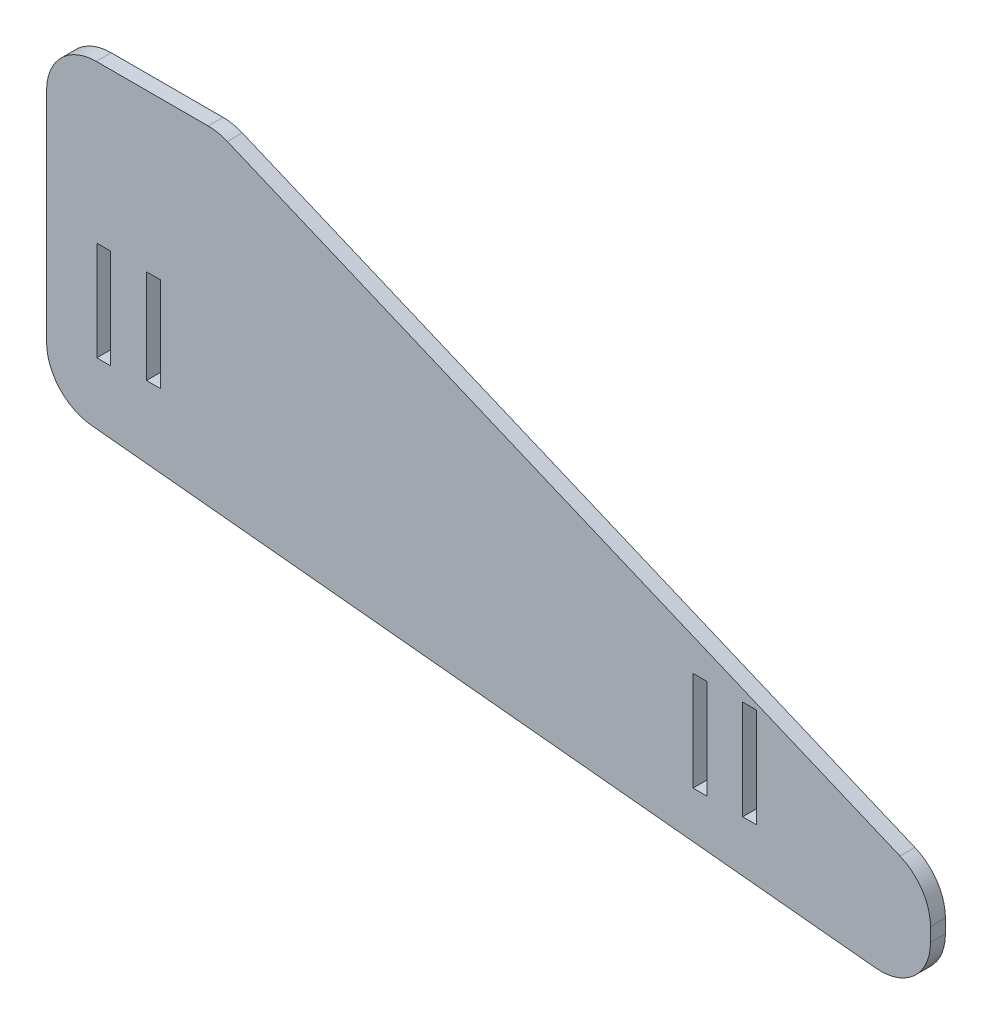
ISO-10303-21;
HEADER;
FILE_DESCRIPTION(('STEP AP214'),'2;1');
FILE_NAME('part.step','',(''),(''),'','','');
FILE_SCHEMA(('AUTOMOTIVE_DESIGN { 1 0 10303 214 1 1 1 1 }'));
ENDSEC;
DATA;
#1=APPLICATION_CONTEXT('core data for automotive mechanical design processes');
#2=APPLICATION_PROTOCOL_DEFINITION('international standard','automotive_design',2000,#1);
#3=PRODUCT_CONTEXT('',#1,'mechanical');
#4=PRODUCT('Part','Part','',(#3));
#5=PRODUCT_RELATED_PRODUCT_CATEGORY('part','',(#4));
#6=PRODUCT_DEFINITION_FORMATION('','',#4);
#7=PRODUCT_DEFINITION_CONTEXT('part definition',#1,'design');
#8=PRODUCT_DEFINITION('design','',#6,#7);
#9=PRODUCT_DEFINITION_SHAPE('','',#8);
#10=(LENGTH_UNIT() NAMED_UNIT(*) SI_UNIT(.MILLI.,.METRE.));
#11=(NAMED_UNIT(*) PLANE_ANGLE_UNIT() SI_UNIT($,.RADIAN.));
#12=(NAMED_UNIT(*) SI_UNIT($,.STERADIAN.) SOLID_ANGLE_UNIT());
#13=UNCERTAINTY_MEASURE_WITH_UNIT(LENGTH_MEASURE(1.E-05),#10,'distance_accuracy_value','');
#14=(GEOMETRIC_REPRESENTATION_CONTEXT(3) GLOBAL_UNCERTAINTY_ASSIGNED_CONTEXT((#13)) GLOBAL_UNIT_ASSIGNED_CONTEXT((#10,
#11,#12)) REPRESENTATION_CONTEXT('',''));
#15=CARTESIAN_POINT('',(0.,0.,0.));
#16=DIRECTION('',(0.,0.,1.));
#17=DIRECTION('',(1.,0.,0.));
#18=AXIS2_PLACEMENT_3D('',#15,#16,#17);
#19=CARTESIAN_POINT('',(0.,0.,3.));
#20=DIRECTION('',(0.,0.,1.));
#21=DIRECTION('',(1.,0.,0.));
#22=AXIS2_PLACEMENT_3D('',#19,#20,#21);
#23=PLANE('',#22);
#24=DIRECTION('',(-0.921998261236176,0.387194016324463,0.));
#25=VECTOR('',#24,1.);
#26=CARTESIAN_POINT('',(5.00000000000007,103.817072851168,3.));
#27=LINE('',#26,#25);
#28=CARTESIAN_POINT('',(151.771940163245,42.180061823244,3.));
#29=VERTEX_POINT('',#28);
#30=CARTESIAN_POINT('',(16.3823239365044,99.0370554635292,3.));
#31=VERTEX_POINT('',#30);
#32=EDGE_CURVE('E354',#29,#31,#27,.T.);
#33=ORIENTED_EDGE('',*,*,#32,.T.);
#34=CARTESIAN_POINT('',(12.5103837732597,89.8170728511675,3.));
#35=DIRECTION('',(0.,0.,1.));
#36=DIRECTION('',(1.,0.,0.));
#37=AXIS2_PLACEMENT_3D('',#34,#35,#36);
#38=CIRCLE('',#37,10.);
#39=CARTESIAN_POINT('',(12.5103837732597,99.8170728511675,3.));
#40=VERTEX_POINT('',#39);
#41=EDGE_CURVE('E400',#31,#40,#38,.T.);
#42=ORIENTED_EDGE('',*,*,#41,.T.);
#43=DIRECTION('',(1.,0.,0.));
#44=VECTOR('',#43,1.);
#45=CARTESIAN_POINT('',(0.,99.8170728511675,3.));
#46=LINE('',#45,#44);
#47=CARTESIAN_POINT('',(-9.99999999999993,99.8170728511675,3.));
#48=VERTEX_POINT('',#47);
#49=EDGE_CURVE('E241',#48,#40,#46,.T.);
#50=ORIENTED_EDGE('',*,*,#49,.F.);
#51=CARTESIAN_POINT('',(-9.99999999999993,89.8170728511675,3.));
#52=DIRECTION('',(0.,0.,1.));
#53=DIRECTION('',(1.,0.,0.));
#54=AXIS2_PLACEMENT_3D('',#51,#52,#53);
#55=CIRCLE('',#54,10.);
#56=CARTESIAN_POINT('',(-19.9999999999999,89.8170728511675,3.));
#57=VERTEX_POINT('',#56);
#58=EDGE_CURVE('E398',#48,#57,#55,.T.);
#59=ORIENTED_EDGE('',*,*,#58,.T.);
#60=DIRECTION('',(0.,-1.,0.));
#61=VECTOR('',#60,1.);
#62=CARTESIAN_POINT('',(-19.9999999999999,103.817072851167,3.));
#63=LINE('',#62,#61);
#64=CARTESIAN_POINT('',(-19.9999999999999,45.8360711378308,3.));
#65=VERTEX_POINT('',#64);
#66=EDGE_CURVE('E345',#57,#65,#63,.T.);
#67=ORIENTED_EDGE('',*,*,#66,.T.);
#68=CARTESIAN_POINT('',(-9.99999999999993,45.8360711378308,3.));
#69=DIRECTION('',(0.,0.,1.));
#70=DIRECTION('',(1.,0.,0.));
#71=AXIS2_PLACEMENT_3D('',#68,#69,#70);
#72=CIRCLE('',#71,10.);
#73=CARTESIAN_POINT('',(-10.9874285972225,35.8849413142687,3.));
#74=VERTEX_POINT('',#73);
#75=EDGE_CURVE('E383',#65,#74,#72,.T.);
#76=ORIENTED_EDGE('',*,*,#75,.T.);
#77=DIRECTION('',(0.995112982356209,-0.0987428597222623,0.));
#78=VECTOR('',#77,1.);
#79=CARTESIAN_POINT('',(157.9,19.1266154090604,3.));
#80=LINE('',#79,#78);
#81=CARTESIAN_POINT('',(146.912571402777,20.2168736409599,3.));
#82=VERTEX_POINT('',#81);
#83=EDGE_CURVE('E347',#74,#82,#80,.T.);
#84=ORIENTED_EDGE('',*,*,#83,.T.);
#85=CARTESIAN_POINT('',(147.9,30.168003464522,3.));
#86=DIRECTION('',(0.,0.,1.));
#87=DIRECTION('',(1.,0.,0.));
#88=AXIS2_PLACEMENT_3D('',#85,#86,#87);
#89=CIRCLE('',#88,10.);
#90=CARTESIAN_POINT('',(157.9,30.1680034645221,3.));
#91=VERTEX_POINT('',#90);
#92=EDGE_CURVE('E387',#82,#91,#89,.T.);
#93=ORIENTED_EDGE('',*,*,#92,.T.);
#94=DIRECTION('',(0.,1.,0.));
#95=VECTOR('',#94,1.);
#96=CARTESIAN_POINT('',(157.9,19.1266154090604,3.));
#97=LINE('',#96,#95);
#98=CARTESIAN_POINT('',(157.9,32.9600792108823,3.));
#99=VERTEX_POINT('',#98);
#100=EDGE_CURVE('E351',#91,#99,#97,.T.);
#101=ORIENTED_EDGE('',*,*,#100,.T.);
#102=CARTESIAN_POINT('',(147.9,32.9600792108823,3.));
#103=DIRECTION('',(0.,0.,1.));
#104=DIRECTION('',(1.,0.,0.));
#105=AXIS2_PLACEMENT_3D('',#102,#103,#104);
#106=CIRCLE('',#105,10.);
#107=EDGE_CURVE('E385',#99,#29,#106,.T.);
#108=ORIENTED_EDGE('',*,*,#107,.T.);
#109=EDGE_LOOP('',(#33,#42,#50,#59,#67,#76,#84,#93,#101,#108));
#110=FACE_BOUND('',#109,.T.);
#111=DIRECTION('',(-1.,0.,0.));
#112=VECTOR('',#111,1.);
#113=CARTESIAN_POINT('',(2.90000000000006,68.194495368182,3.));
#114=LINE('',#113,#112);
#115=CARTESIAN_POINT('',(2.90000000000006,68.194495368182,3.));
#116=VERTEX_POINT('',#115);
#117=CARTESIAN_POINT('',(0.100000000000059,68.194495368182,3.));
#118=VERTEX_POINT('',#117);
#119=EDGE_CURVE('E254',#116,#118,#114,.T.);
#120=ORIENTED_EDGE('',*,*,#119,.F.);
#121=DIRECTION('',(0.,1.,0.));
#122=VECTOR('',#121,1.);
#123=CARTESIAN_POINT('',(2.90000000000006,49.2417896319157,3.));
#124=LINE('',#123,#122);
#125=CARTESIAN_POINT('',(2.90000000000006,49.2417896319157,3.));
#126=VERTEX_POINT('',#125);
#127=EDGE_CURVE('E252',#126,#116,#124,.T.);
#128=ORIENTED_EDGE('',*,*,#127,.F.);
#129=DIRECTION('',(1.,0.,0.));
#130=VECTOR('',#129,1.);
#131=CARTESIAN_POINT('',(0.100000000000062,49.2417896319157,3.));
#132=LINE('',#131,#130);
#133=CARTESIAN_POINT('',(0.100000000000062,49.2417896319157,3.));
#134=VERTEX_POINT('',#133);
#135=EDGE_CURVE('E260',#134,#126,#132,.T.);
#136=ORIENTED_EDGE('',*,*,#135,.F.);
#137=DIRECTION('',(0.,-1.,0.));
#138=VECTOR('',#137,1.);
#139=CARTESIAN_POINT('',(0.100000000000059,68.194495368182,3.));
#140=LINE('',#139,#138);
#141=EDGE_CURVE('E257',#118,#134,#140,.T.);
#142=ORIENTED_EDGE('',*,*,#141,.F.);
#143=EDGE_LOOP('',(#120,#128,#136,#142));
#144=FACE_BOUND('',#143,.T.);
#145=DIRECTION('',(1.,0.,0.));
#146=VECTOR('',#145,1.);
#147=CARTESIAN_POINT('',(110.1,33.1944953681821,3.));
#148=LINE('',#147,#146);
#149=CARTESIAN_POINT('',(110.1,33.1944953681821,3.));
#150=VERTEX_POINT('',#149);
#151=CARTESIAN_POINT('',(112.9,33.1944953681821,3.));
#152=VERTEX_POINT('',#151);
#153=EDGE_CURVE('E316',#150,#152,#148,.T.);
#154=ORIENTED_EDGE('',*,*,#153,.F.);
#155=DIRECTION('',(0.,-1.,0.));
#156=VECTOR('',#155,1.);
#157=CARTESIAN_POINT('',(110.1,53.1944953681821,3.));
#158=LINE('',#157,#156);
#159=CARTESIAN_POINT('',(110.1,53.1944953681821,3.));
#160=VERTEX_POINT('',#159);
#161=EDGE_CURVE('E314',#160,#150,#158,.T.);
#162=ORIENTED_EDGE('',*,*,#161,.F.);
#163=DIRECTION('',(-1.,0.,0.));
#164=VECTOR('',#163,1.);
#165=CARTESIAN_POINT('',(110.1,53.1944953681821,3.));
#166=LINE('',#165,#164);
#167=CARTESIAN_POINT('',(112.9,53.1944953681821,3.));
#168=VERTEX_POINT('',#167);
#169=EDGE_CURVE('E322',#168,#160,#166,.T.);
#170=ORIENTED_EDGE('',*,*,#169,.F.);
#171=DIRECTION('',(0.,1.,0.));
#172=VECTOR('',#171,1.);
#173=CARTESIAN_POINT('',(112.9,53.1944953681821,3.));
#174=LINE('',#173,#172);
#175=EDGE_CURVE('E319',#152,#168,#174,.T.);
#176=ORIENTED_EDGE('',*,*,#175,.F.);
#177=EDGE_LOOP('',(#154,#162,#170,#176));
#178=FACE_BOUND('',#177,.T.);
#179=DIRECTION('',(-1.,0.,0.));
#180=VECTOR('',#179,1.);
#181=CARTESIAN_POINT('',(-7.09999999999994,68.194495368182,3.));
#182=LINE('',#181,#180);
#183=CARTESIAN_POINT('',(-7.09999999999994,68.194495368182,3.));
#184=VERTEX_POINT('',#183);
#185=CARTESIAN_POINT('',(-9.89999999999994,68.194495368182,3.));
#186=VERTEX_POINT('',#185);
#187=EDGE_CURVE('E285',#184,#186,#182,.T.);
#188=ORIENTED_EDGE('',*,*,#187,.F.);
#189=DIRECTION('',(0.,1.,0.));
#190=VECTOR('',#189,1.);
#191=CARTESIAN_POINT('',(-7.09999999999994,48.194495365682,3.));
#192=LINE('',#191,#190);
#193=CARTESIAN_POINT('',(-7.09999999999994,48.194495365682,3.));
#194=VERTEX_POINT('',#193);
#195=EDGE_CURVE('E283',#194,#184,#192,.T.);
#196=ORIENTED_EDGE('',*,*,#195,.F.);
#197=DIRECTION('',(1.,0.,0.));
#198=VECTOR('',#197,1.);
#199=CARTESIAN_POINT('',(-9.89999999999993,48.194495365682,3.));
#200=LINE('',#199,#198);
#201=CARTESIAN_POINT('',(-9.89999999999993,48.194495365682,3.));
#202=VERTEX_POINT('',#201);
#203=EDGE_CURVE('E291',#202,#194,#200,.T.);
#204=ORIENTED_EDGE('',*,*,#203,.F.);
#205=DIRECTION('',(0.,-1.,0.));
#206=VECTOR('',#205,1.);
#207=CARTESIAN_POINT('',(-9.89999999999994,68.194495368182,3.));
#208=LINE('',#207,#206);
#209=EDGE_CURVE('E288',#186,#202,#208,.T.);
#210=ORIENTED_EDGE('',*,*,#209,.F.);
#211=EDGE_LOOP('',(#188,#196,#204,#210));
#212=FACE_BOUND('',#211,.T.);
#213=DIRECTION('',(1.,0.,0.));
#214=VECTOR('',#213,1.);
#215=CARTESIAN_POINT('',(120.1,33.1944953681821,3.));
#216=LINE('',#215,#214);
#217=CARTESIAN_POINT('',(120.1,33.1944953681821,3.));
#218=VERTEX_POINT('',#217);
#219=CARTESIAN_POINT('',(122.9,33.1944953681821,3.));
#220=VERTEX_POINT('',#219);
#221=EDGE_CURVE('E219',#218,#220,#216,.T.);
#222=ORIENTED_EDGE('',*,*,#221,.F.);
#223=DIRECTION('',(0.,-1.,0.));
#224=VECTOR('',#223,1.);
#225=CARTESIAN_POINT('',(120.1,53.1944953681821,3.));
#226=LINE('',#225,#224);
#227=CARTESIAN_POINT('',(120.1,53.1944953681821,3.));
#228=VERTEX_POINT('',#227);
#229=EDGE_CURVE('E209',#228,#218,#226,.T.);
#230=ORIENTED_EDGE('',*,*,#229,.F.);
#231=DIRECTION('',(-1.,0.,0.));
#232=VECTOR('',#231,1.);
#233=CARTESIAN_POINT('',(120.1,53.1944953681821,3.));
#234=LINE('',#233,#232);
#235=CARTESIAN_POINT('',(122.9,53.1944953681821,3.));
#236=VERTEX_POINT('',#235);
#237=EDGE_CURVE('E234',#236,#228,#234,.T.);
#238=ORIENTED_EDGE('',*,*,#237,.F.);
#239=DIRECTION('',(0.,1.,0.));
#240=VECTOR('',#239,1.);
#241=CARTESIAN_POINT('',(122.9,53.1944953681821,3.));
#242=LINE('',#241,#240);
#243=EDGE_CURVE('E232',#220,#236,#242,.T.);
#244=ORIENTED_EDGE('',*,*,#243,.F.);
#245=EDGE_LOOP('',(#222,#230,#238,#244));
#246=FACE_BOUND('',#245,.T.);
#247=ADVANCED_FACE('F35',(#110,#144,#178,#212,#246),#23,.T.);
#248=CARTESIAN_POINT('',(0.,0.,0.));
#249=DIRECTION('',(0.,0.,1.));
#250=DIRECTION('',(1.,0.,0.));
#251=AXIS2_PLACEMENT_3D('',#248,#249,#250);
#252=PLANE('',#251);
#253=DIRECTION('',(0.,1.,0.));
#254=VECTOR('',#253,1.);
#255=CARTESIAN_POINT('',(2.90000000000006,49.2417896319157,0.));
#256=LINE('',#255,#254);
#257=CARTESIAN_POINT('',(2.90000000000006,49.2417896319157,0.));
#258=VERTEX_POINT('',#257);
#259=CARTESIAN_POINT('',(2.90000000000006,68.194495368182,0.));
#260=VERTEX_POINT('',#259);
#261=EDGE_CURVE('E227',#258,#260,#256,.T.);
#262=ORIENTED_EDGE('',*,*,#261,.T.);
#263=DIRECTION('',(-1.,0.,0.));
#264=VECTOR('',#263,1.);
#265=CARTESIAN_POINT('',(2.90000000000006,68.194495368182,0.));
#266=LINE('',#265,#264);
#267=CARTESIAN_POINT('',(0.100000000000059,68.194495368182,0.));
#268=VERTEX_POINT('',#267);
#269=EDGE_CURVE('E265',#260,#268,#266,.T.);
#270=ORIENTED_EDGE('',*,*,#269,.T.);
#271=DIRECTION('',(0.,-1.,0.));
#272=VECTOR('',#271,1.);
#273=CARTESIAN_POINT('',(0.100000000000059,68.194495368182,0.));
#274=LINE('',#273,#272);
#275=CARTESIAN_POINT('',(0.100000000000062,49.2417896319157,0.));
#276=VERTEX_POINT('',#275);
#277=EDGE_CURVE('E268',#268,#276,#274,.T.);
#278=ORIENTED_EDGE('',*,*,#277,.T.);
#279=DIRECTION('',(1.,0.,0.));
#280=VECTOR('',#279,1.);
#281=CARTESIAN_POINT('',(0.100000000000062,49.2417896319157,0.));
#282=LINE('',#281,#280);
#283=EDGE_CURVE('E255',#276,#258,#282,.T.);
#284=ORIENTED_EDGE('',*,*,#283,.T.);
#285=EDGE_LOOP('',(#262,#270,#278,#284));
#286=FACE_BOUND('',#285,.T.);
#287=DIRECTION('',(0.,-1.,0.));
#288=VECTOR('',#287,1.);
#289=CARTESIAN_POINT('',(110.1,53.1944953681821,0.));
#290=LINE('',#289,#288);
#291=CARTESIAN_POINT('',(110.1,53.1944953681821,0.));
#292=VERTEX_POINT('',#291);
#293=CARTESIAN_POINT('',(110.1,33.1944953681821,0.));
#294=VERTEX_POINT('',#293);
#295=EDGE_CURVE('E313',#292,#294,#290,.T.);
#296=ORIENTED_EDGE('',*,*,#295,.T.);
#297=DIRECTION('',(1.,0.,0.));
#298=VECTOR('',#297,1.);
#299=CARTESIAN_POINT('',(110.1,33.1944953681821,0.));
#300=LINE('',#299,#298);
#301=CARTESIAN_POINT('',(112.9,33.1944953681821,0.));
#302=VERTEX_POINT('',#301);
#303=EDGE_CURVE('E327',#294,#302,#300,.T.);
#304=ORIENTED_EDGE('',*,*,#303,.T.);
#305=DIRECTION('',(0.,1.,0.));
#306=VECTOR('',#305,1.);
#307=CARTESIAN_POINT('',(112.9,53.1944953681821,0.));
#308=LINE('',#307,#306);
#309=CARTESIAN_POINT('',(112.9,53.1944953681821,0.));
#310=VERTEX_POINT('',#309);
#311=EDGE_CURVE('E330',#302,#310,#308,.T.);
#312=ORIENTED_EDGE('',*,*,#311,.T.);
#313=DIRECTION('',(-1.,0.,0.));
#314=VECTOR('',#313,1.);
#315=CARTESIAN_POINT('',(110.1,53.1944953681821,0.));
#316=LINE('',#315,#314);
#317=EDGE_CURVE('E317',#310,#292,#316,.T.);
#318=ORIENTED_EDGE('',*,*,#317,.T.);
#319=EDGE_LOOP('',(#296,#304,#312,#318));
#320=FACE_BOUND('',#319,.T.);
#321=DIRECTION('',(-1.,0.,0.));
#322=VECTOR('',#321,1.);
#323=CARTESIAN_POINT('',(-19.9999999999999,99.8170728511675,0.));
#324=LINE('',#323,#322);
#325=CARTESIAN_POINT('',(12.5103837732597,99.8170728511675,0.));
#326=VERTEX_POINT('',#325);
#327=CARTESIAN_POINT('',(-9.99999999999993,99.8170728511675,0.));
#328=VERTEX_POINT('',#327);
#329=EDGE_CURVE('E410',#326,#328,#324,.T.);
#330=ORIENTED_EDGE('',*,*,#329,.F.);
#331=CARTESIAN_POINT('',(12.5103837732597,89.8170728511675,0.));
#332=DIRECTION('',(0.,0.,1.));
#333=DIRECTION('',(1.,0.,0.));
#334=AXIS2_PLACEMENT_3D('',#331,#332,#333);
#335=CIRCLE('',#334,10.);
#336=CARTESIAN_POINT('',(16.3823239365044,99.0370554635292,0.));
#337=VERTEX_POINT('',#336);
#338=EDGE_CURVE('E43',#326,#337,#335,.F.);
#339=ORIENTED_EDGE('',*,*,#338,.T.);
#340=DIRECTION('',(-0.921998261236176,0.387194016324463,0.));
#341=VECTOR('',#340,1.);
#342=CARTESIAN_POINT('',(5.00000000000007,103.817072851168,0.));
#343=LINE('',#342,#341);
#344=CARTESIAN_POINT('',(151.771940163245,42.180061823244,0.));
#345=VERTEX_POINT('',#344);
#346=EDGE_CURVE('E348',#345,#337,#343,.T.);
#347=ORIENTED_EDGE('',*,*,#346,.F.);
#348=CARTESIAN_POINT('',(147.9,32.9600792108823,0.));
#349=DIRECTION('',(0.,0.,1.));
#350=DIRECTION('',(1.,0.,0.));
#351=AXIS2_PLACEMENT_3D('',#348,#349,#350);
#352=CIRCLE('',#351,10.);
#353=CARTESIAN_POINT('',(157.9,32.9600792108823,0.));
#354=VERTEX_POINT('',#353);
#355=EDGE_CURVE('E374',#345,#354,#352,.F.);
#356=ORIENTED_EDGE('',*,*,#355,.T.);
#357=DIRECTION('',(0.,1.,0.));
#358=VECTOR('',#357,1.);
#359=CARTESIAN_POINT('',(157.9,19.1266154090604,0.));
#360=LINE('',#359,#358);
#361=CARTESIAN_POINT('',(157.9,30.1680034645221,0.));
#362=VERTEX_POINT('',#361);
#363=EDGE_CURVE('E362',#362,#354,#360,.T.);
#364=ORIENTED_EDGE('',*,*,#363,.F.);
#365=CARTESIAN_POINT('',(147.9,30.168003464522,0.));
#366=DIRECTION('',(0.,0.,1.));
#367=DIRECTION('',(1.,0.,0.));
#368=AXIS2_PLACEMENT_3D('',#365,#366,#367);
#369=CIRCLE('',#368,10.);
#370=CARTESIAN_POINT('',(146.912571402777,20.2168736409599,0.));
#371=VERTEX_POINT('',#370);
#372=EDGE_CURVE('E376',#362,#371,#369,.F.);
#373=ORIENTED_EDGE('',*,*,#372,.T.);
#374=DIRECTION('',(0.995112982356209,-0.0987428597222623,0.));
#375=VECTOR('',#374,1.);
#376=CARTESIAN_POINT('',(157.9,19.1266154090604,0.));
#377=LINE('',#376,#375);
#378=CARTESIAN_POINT('',(-10.9874285972225,35.8849413142687,0.));
#379=VERTEX_POINT('',#378);
#380=EDGE_CURVE('E359',#379,#371,#377,.T.);
#381=ORIENTED_EDGE('',*,*,#380,.F.);
#382=CARTESIAN_POINT('',(-9.99999999999993,45.8360711378308,0.));
#383=DIRECTION('',(0.,0.,1.));
#384=DIRECTION('',(1.,0.,0.));
#385=AXIS2_PLACEMENT_3D('',#382,#383,#384);
#386=CIRCLE('',#385,10.);
#387=CARTESIAN_POINT('',(-19.9999999999999,45.8360711378308,0.));
#388=VERTEX_POINT('',#387);
#389=EDGE_CURVE('E371',#379,#388,#386,.F.);
#390=ORIENTED_EDGE('',*,*,#389,.T.);
#391=DIRECTION('',(0.,-1.,0.));
#392=VECTOR('',#391,1.);
#393=CARTESIAN_POINT('',(-19.9999999999999,103.817072851167,0.));
#394=LINE('',#393,#392);
#395=CARTESIAN_POINT('',(-19.9999999999999,89.8170728511675,0.));
#396=VERTEX_POINT('',#395);
#397=EDGE_CURVE('E344',#396,#388,#394,.T.);
#398=ORIENTED_EDGE('',*,*,#397,.F.);
#399=CARTESIAN_POINT('',(-9.99999999999993,89.8170728511675,0.));
#400=DIRECTION('',(0.,0.,1.));
#401=DIRECTION('',(1.,0.,0.));
#402=AXIS2_PLACEMENT_3D('',#399,#400,#401);
#403=CIRCLE('',#402,10.);
#404=EDGE_CURVE('E50',#396,#328,#403,.F.);
#405=ORIENTED_EDGE('',*,*,#404,.T.);
#406=EDGE_LOOP('',(#330,#339,#347,#356,#364,#373,#381,#390,#398,#405));
#407=FACE_BOUND('',#406,.T.);
#408=DIRECTION('',(0.,1.,0.));
#409=VECTOR('',#408,1.);
#410=CARTESIAN_POINT('',(-7.09999999999994,48.194495365682,0.));
#411=LINE('',#410,#409);
#412=CARTESIAN_POINT('',(-7.09999999999994,48.194495365682,0.));
#413=VERTEX_POINT('',#412);
#414=CARTESIAN_POINT('',(-7.09999999999994,68.194495368182,0.));
#415=VERTEX_POINT('',#414);
#416=EDGE_CURVE('E282',#413,#415,#411,.T.);
#417=ORIENTED_EDGE('',*,*,#416,.T.);
#418=DIRECTION('',(-1.,0.,0.));
#419=VECTOR('',#418,1.);
#420=CARTESIAN_POINT('',(-7.09999999999994,68.194495368182,0.));
#421=LINE('',#420,#419);
#422=CARTESIAN_POINT('',(-9.89999999999994,68.194495368182,0.));
#423=VERTEX_POINT('',#422);
#424=EDGE_CURVE('E296',#415,#423,#421,.T.);
#425=ORIENTED_EDGE('',*,*,#424,.T.);
#426=DIRECTION('',(0.,-1.,0.));
#427=VECTOR('',#426,1.);
#428=CARTESIAN_POINT('',(-9.89999999999994,68.194495368182,0.));
#429=LINE('',#428,#427);
#430=CARTESIAN_POINT('',(-9.89999999999993,48.194495365682,0.));
#431=VERTEX_POINT('',#430);
#432=EDGE_CURVE('E299',#423,#431,#429,.T.);
#433=ORIENTED_EDGE('',*,*,#432,.T.);
#434=DIRECTION('',(1.,0.,0.));
#435=VECTOR('',#434,1.);
#436=CARTESIAN_POINT('',(-9.89999999999993,48.194495365682,0.));
#437=LINE('',#436,#435);
#438=EDGE_CURVE('E286',#431,#413,#437,.T.);
#439=ORIENTED_EDGE('',*,*,#438,.T.);
#440=EDGE_LOOP('',(#417,#425,#433,#439));
#441=FACE_BOUND('',#440,.T.);
#442=DIRECTION('',(0.,-1.,0.));
#443=VECTOR('',#442,1.);
#444=CARTESIAN_POINT('',(120.1,53.1944953681821,0.));
#445=LINE('',#444,#443);
#446=CARTESIAN_POINT('',(120.1,53.1944953681821,0.));
#447=VERTEX_POINT('',#446);
#448=CARTESIAN_POINT('',(120.1,33.1944953681821,0.));
#449=VERTEX_POINT('',#448);
#450=EDGE_CURVE('E239',#447,#449,#445,.T.);
#451=ORIENTED_EDGE('',*,*,#450,.T.);
#452=DIRECTION('',(1.,0.,0.));
#453=VECTOR('',#452,1.);
#454=CARTESIAN_POINT('',(120.1,33.1944953681821,0.));
#455=LINE('',#454,#453);
#456=CARTESIAN_POINT('',(122.9,33.1944953681821,0.));
#457=VERTEX_POINT('',#456);
#458=EDGE_CURVE('E226',#449,#457,#455,.T.);
#459=ORIENTED_EDGE('',*,*,#458,.T.);
#460=DIRECTION('',(0.,1.,0.));
#461=VECTOR('',#460,1.);
#462=CARTESIAN_POINT('',(122.9,53.1944953681821,0.));
#463=LINE('',#462,#461);
#464=CARTESIAN_POINT('',(122.9,53.1944953681821,0.));
#465=VERTEX_POINT('',#464);
#466=EDGE_CURVE('E243',#457,#465,#463,.T.);
#467=ORIENTED_EDGE('',*,*,#466,.T.);
#468=DIRECTION('',(-1.,0.,0.));
#469=VECTOR('',#468,1.);
#470=CARTESIAN_POINT('',(120.1,53.1944953681821,0.));
#471=LINE('',#470,#469);
#472=EDGE_CURVE('E220',#465,#447,#471,.T.);
#473=ORIENTED_EDGE('',*,*,#472,.T.);
#474=EDGE_LOOP('',(#451,#459,#467,#473));
#475=FACE_BOUND('',#474,.T.);
#476=ADVANCED_FACE('F408',(#286,#320,#407,#441,#475),#252,.F.);
#477=CARTESIAN_POINT('',(-19.9999999999999,103.817072851167,3.));
#478=DIRECTION('',(1.,0.,0.));
#479=DIRECTION('',(0.,0.,-1.));
#480=AXIS2_PLACEMENT_3D('',#477,#478,#479);
#481=PLANE('',#480);
#482=ORIENTED_EDGE('',*,*,#66,.F.);
#483=DIRECTION('',(0.,0.,-1.));
#484=VECTOR('',#483,1.);
#485=CARTESIAN_POINT('',(-19.9999999999999,89.8170728511675,3.));
#486=LINE('',#485,#484);
#487=EDGE_CURVE('E11',#57,#396,#486,.T.);
#488=ORIENTED_EDGE('',*,*,#487,.T.);
#489=ORIENTED_EDGE('',*,*,#397,.T.);
#490=DIRECTION('',(0.,0.,-1.));
#491=VECTOR('',#490,1.);
#492=CARTESIAN_POINT('',(-19.9999999999999,45.8360711378308,3.));
#493=LINE('',#492,#491);
#494=EDGE_CURVE('E392',#388,#65,#493,.F.);
#495=ORIENTED_EDGE('',*,*,#494,.T.);
#496=EDGE_LOOP('',(#482,#488,#489,#495));
#497=FACE_BOUND('',#496,.T.);
#498=ADVANCED_FACE('F429',(#497),#481,.F.);
#499=CARTESIAN_POINT('',(157.9,19.1266154090604,3.));
#500=DIRECTION('',(0.0987428597222623,0.995112982356209,0.));
#501=DIRECTION('',(-0.995112982356209,0.0987428597222623,0.));
#502=AXIS2_PLACEMENT_3D('',#499,#500,#501);
#503=PLANE('',#502);
#504=ORIENTED_EDGE('',*,*,#380,.T.);
#505=DIRECTION('',(0.,0.,-1.));
#506=VECTOR('',#505,1.);
#507=CARTESIAN_POINT('',(146.912571402777,20.2168736409599,3.));
#508=LINE('',#507,#506);
#509=EDGE_CURVE('E381',#371,#82,#508,.F.);
#510=ORIENTED_EDGE('',*,*,#509,.T.);
#511=ORIENTED_EDGE('',*,*,#83,.F.);
#512=DIRECTION('',(0.,0.,-1.));
#513=VECTOR('',#512,1.);
#514=CARTESIAN_POINT('',(-10.9874285972225,35.8849413142687,3.));
#515=LINE('',#514,#513);
#516=EDGE_CURVE('E378',#74,#379,#515,.T.);
#517=ORIENTED_EDGE('',*,*,#516,.T.);
#518=EDGE_LOOP('',(#504,#510,#511,#517));
#519=FACE_BOUND('',#518,.T.);
#520=ADVANCED_FACE('F438',(#519),#503,.F.);
#521=CARTESIAN_POINT('',(157.9,19.1266154090604,3.));
#522=DIRECTION('',(-1.,0.,0.));
#523=DIRECTION('',(0.,-1.,0.));
#524=AXIS2_PLACEMENT_3D('',#521,#522,#523);
#525=PLANE('',#524);
#526=ORIENTED_EDGE('',*,*,#100,.F.);
#527=DIRECTION('',(0.,0.,-1.));
#528=VECTOR('',#527,1.);
#529=CARTESIAN_POINT('',(157.9,30.1680034645221,3.));
#530=LINE('',#529,#528);
#531=EDGE_CURVE('E368',#91,#362,#530,.T.);
#532=ORIENTED_EDGE('',*,*,#531,.T.);
#533=ORIENTED_EDGE('',*,*,#363,.T.);
#534=DIRECTION('',(0.,0.,-1.));
#535=VECTOR('',#534,1.);
#536=CARTESIAN_POINT('',(157.9,32.9600792108823,3.));
#537=LINE('',#536,#535);
#538=EDGE_CURVE('E357',#354,#99,#537,.F.);
#539=ORIENTED_EDGE('',*,*,#538,.T.);
#540=EDGE_LOOP('',(#526,#532,#533,#539));
#541=FACE_BOUND('',#540,.T.);
#542=ADVANCED_FACE('F447',(#541),#525,.F.);
#543=CARTESIAN_POINT('',(5.00000000000007,103.817072851168,3.));
#544=DIRECTION('',(-0.387194016324463,-0.921998261236176,0.));
#545=DIRECTION('',(0.921998261236176,-0.387194016324463,0.));
#546=AXIS2_PLACEMENT_3D('',#543,#544,#545);
#547=PLANE('',#546);
#548=ORIENTED_EDGE('',*,*,#346,.T.);
#549=DIRECTION('',(0.,0.,1.));
#550=VECTOR('',#549,1.);
#551=CARTESIAN_POINT('',(16.3823239365044,99.0370554635292,3.));
#552=LINE('',#551,#550);
#553=EDGE_CURVE('E395',#337,#31,#552,.T.);
#554=ORIENTED_EDGE('',*,*,#553,.T.);
#555=ORIENTED_EDGE('',*,*,#32,.F.);
#556=DIRECTION('',(0.,0.,-1.));
#557=VECTOR('',#556,1.);
#558=CARTESIAN_POINT('',(151.771940163245,42.1800618232441,3.));
#559=LINE('',#558,#557);
#560=EDGE_CURVE('E389',#29,#345,#559,.T.);
#561=ORIENTED_EDGE('',*,*,#560,.T.);
#562=EDGE_LOOP('',(#548,#554,#555,#561));
#563=FACE_BOUND('',#562,.T.);
#564=ADVANCED_FACE('F415',(#563),#547,.F.);
#565=CARTESIAN_POINT('',(110.1,53.1944953681821,3.));
#566=DIRECTION('',(1.,0.,0.));
#567=DIRECTION('',(0.,0.,-1.));
#568=AXIS2_PLACEMENT_3D('',#565,#566,#567);
#569=PLANE('',#568);
#570=ORIENTED_EDGE('',*,*,#295,.F.);
#571=DIRECTION('',(0.,0.,-1.));
#572=VECTOR('',#571,1.);
#573=CARTESIAN_POINT('',(110.1,53.1944953681821,3.));
#574=LINE('',#573,#572);
#575=EDGE_CURVE('E324',#160,#292,#574,.T.);
#576=ORIENTED_EDGE('',*,*,#575,.F.);
#577=ORIENTED_EDGE('',*,*,#161,.T.);
#578=DIRECTION('',(0.,0.,-1.));
#579=VECTOR('',#578,1.);
#580=CARTESIAN_POINT('',(110.1,33.1944953681821,3.));
#581=LINE('',#580,#579);
#582=EDGE_CURVE('E341',#150,#294,#581,.T.);
#583=ORIENTED_EDGE('',*,*,#582,.T.);
#584=EDGE_LOOP('',(#570,#576,#577,#583));
#585=FACE_BOUND('',#584,.T.);
#586=ADVANCED_FACE('F469',(#585),#569,.T.);
#587=CARTESIAN_POINT('',(110.1,33.1944953681821,3.));
#588=DIRECTION('',(0.,1.,0.));
#589=DIRECTION('',(0.,0.,1.));
#590=AXIS2_PLACEMENT_3D('',#587,#588,#589);
#591=PLANE('',#590);
#592=ORIENTED_EDGE('',*,*,#303,.F.);
#593=ORIENTED_EDGE('',*,*,#582,.F.);
#594=ORIENTED_EDGE('',*,*,#153,.T.);
#595=DIRECTION('',(0.,0.,-1.));
#596=VECTOR('',#595,1.);
#597=CARTESIAN_POINT('',(112.9,33.1944953681821,3.));
#598=LINE('',#597,#596);
#599=EDGE_CURVE('E339',#152,#302,#598,.T.);
#600=ORIENTED_EDGE('',*,*,#599,.T.);
#601=EDGE_LOOP('',(#592,#593,#594,#600));
#602=FACE_BOUND('',#601,.T.);
#603=ADVANCED_FACE('F504',(#602),#591,.T.);
#604=CARTESIAN_POINT('',(112.9,53.1944953681821,3.));
#605=DIRECTION('',(-1.,0.,0.));
#606=DIRECTION('',(0.,0.,1.));
#607=AXIS2_PLACEMENT_3D('',#604,#605,#606);
#608=PLANE('',#607);
#609=ORIENTED_EDGE('',*,*,#311,.F.);
#610=ORIENTED_EDGE('',*,*,#599,.F.);
#611=ORIENTED_EDGE('',*,*,#175,.T.);
#612=DIRECTION('',(0.,0.,-1.));
#613=VECTOR('',#612,1.);
#614=CARTESIAN_POINT('',(112.9,53.1944953681821,3.));
#615=LINE('',#614,#613);
#616=EDGE_CURVE('E337',#168,#310,#615,.T.);
#617=ORIENTED_EDGE('',*,*,#616,.T.);
#618=EDGE_LOOP('',(#609,#610,#611,#617));
#619=FACE_BOUND('',#618,.T.);
#620=ADVANCED_FACE('F511',(#619),#608,.T.);
#621=CARTESIAN_POINT('',(110.1,53.1944953681821,3.));
#622=DIRECTION('',(0.,-1.,0.));
#623=DIRECTION('',(0.,0.,-1.));
#624=AXIS2_PLACEMENT_3D('',#621,#622,#623);
#625=PLANE('',#624);
#626=ORIENTED_EDGE('',*,*,#317,.F.);
#627=ORIENTED_EDGE('',*,*,#616,.F.);
#628=ORIENTED_EDGE('',*,*,#169,.T.);
#629=ORIENTED_EDGE('',*,*,#575,.T.);
#630=EDGE_LOOP('',(#626,#627,#628,#629));
#631=FACE_BOUND('',#630,.T.);
#632=ADVANCED_FACE('F518',(#631),#625,.T.);
#633=CARTESIAN_POINT('',(-7.09999999999994,48.194495365682,3.));
#634=DIRECTION('',(-1.,0.,0.));
#635=DIRECTION('',(0.,0.,1.));
#636=AXIS2_PLACEMENT_3D('',#633,#634,#635);
#637=PLANE('',#636);
#638=ORIENTED_EDGE('',*,*,#416,.F.);
#639=DIRECTION('',(0.,0.,-1.));
#640=VECTOR('',#639,1.);
#641=CARTESIAN_POINT('',(-7.09999999999994,48.194495365682,3.));
#642=LINE('',#641,#640);
#643=EDGE_CURVE('E293',#194,#413,#642,.T.);
#644=ORIENTED_EDGE('',*,*,#643,.F.);
#645=ORIENTED_EDGE('',*,*,#195,.T.);
#646=DIRECTION('',(0.,0.,-1.));
#647=VECTOR('',#646,1.);
#648=CARTESIAN_POINT('',(-7.09999999999994,68.194495368182,3.));
#649=LINE('',#648,#647);
#650=EDGE_CURVE('E310',#184,#415,#649,.T.);
#651=ORIENTED_EDGE('',*,*,#650,.T.);
#652=EDGE_LOOP('',(#638,#644,#645,#651));
#653=FACE_BOUND('',#652,.T.);
#654=ADVANCED_FACE('F526',(#653),#637,.T.);
#655=CARTESIAN_POINT('',(-7.09999999999994,68.194495368182,3.));
#656=DIRECTION('',(0.,-1.,0.));
#657=DIRECTION('',(0.,0.,-1.));
#658=AXIS2_PLACEMENT_3D('',#655,#656,#657);
#659=PLANE('',#658);
#660=ORIENTED_EDGE('',*,*,#424,.F.);
#661=ORIENTED_EDGE('',*,*,#650,.F.);
#662=ORIENTED_EDGE('',*,*,#187,.T.);
#663=DIRECTION('',(0.,0.,-1.));
#664=VECTOR('',#663,1.);
#665=CARTESIAN_POINT('',(-9.89999999999994,68.194495368182,3.));
#666=LINE('',#665,#664);
#667=EDGE_CURVE('E308',#186,#423,#666,.T.);
#668=ORIENTED_EDGE('',*,*,#667,.T.);
#669=EDGE_LOOP('',(#660,#661,#662,#668));
#670=FACE_BOUND('',#669,.T.);
#671=ADVANCED_FACE('F534',(#670),#659,.T.);
#672=CARTESIAN_POINT('',(-9.89999999999994,68.194495368182,3.));
#673=DIRECTION('',(1.,0.,0.));
#674=DIRECTION('',(0.,1.,0.));
#675=AXIS2_PLACEMENT_3D('',#672,#673,#674);
#676=PLANE('',#675);
#677=ORIENTED_EDGE('',*,*,#432,.F.);
#678=ORIENTED_EDGE('',*,*,#667,.F.);
#679=ORIENTED_EDGE('',*,*,#209,.T.);
#680=DIRECTION('',(0.,0.,-1.));
#681=VECTOR('',#680,1.);
#682=CARTESIAN_POINT('',(-9.89999999999993,48.194495365682,3.));
#683=LINE('',#682,#681);
#684=EDGE_CURVE('E306',#202,#431,#683,.T.);
#685=ORIENTED_EDGE('',*,*,#684,.T.);
#686=EDGE_LOOP('',(#677,#678,#679,#685));
#687=FACE_BOUND('',#686,.T.);
#688=ADVANCED_FACE('F542',(#687),#676,.T.);
#689=CARTESIAN_POINT('',(-9.89999999999993,48.194495365682,3.));
#690=DIRECTION('',(0.,1.,0.));
#691=DIRECTION('',(0.,0.,1.));
#692=AXIS2_PLACEMENT_3D('',#689,#690,#691);
#693=PLANE('',#692);
#694=ORIENTED_EDGE('',*,*,#438,.F.);
#695=ORIENTED_EDGE('',*,*,#684,.F.);
#696=ORIENTED_EDGE('',*,*,#203,.T.);
#697=ORIENTED_EDGE('',*,*,#643,.T.);
#698=EDGE_LOOP('',(#694,#695,#696,#697));
#699=FACE_BOUND('',#698,.T.);
#700=ADVANCED_FACE('F550',(#699),#693,.T.);
#701=CARTESIAN_POINT('',(2.90000000000006,49.2417896319157,3.));
#702=DIRECTION('',(-1.,0.,0.));
#703=DIRECTION('',(0.,-1.,0.));
#704=AXIS2_PLACEMENT_3D('',#701,#702,#703);
#705=PLANE('',#704);
#706=ORIENTED_EDGE('',*,*,#261,.F.);
#707=DIRECTION('',(0.,0.,-1.));
#708=VECTOR('',#707,1.);
#709=CARTESIAN_POINT('',(2.90000000000006,49.2417896319157,3.));
#710=LINE('',#709,#708);
#711=EDGE_CURVE('E262',#126,#258,#710,.T.);
#712=ORIENTED_EDGE('',*,*,#711,.F.);
#713=ORIENTED_EDGE('',*,*,#127,.T.);
#714=DIRECTION('',(0.,0.,-1.));
#715=VECTOR('',#714,1.);
#716=CARTESIAN_POINT('',(2.90000000000006,68.194495368182,3.));
#717=LINE('',#716,#715);
#718=EDGE_CURVE('E279',#116,#260,#717,.T.);
#719=ORIENTED_EDGE('',*,*,#718,.T.);
#720=EDGE_LOOP('',(#706,#712,#713,#719));
#721=FACE_BOUND('',#720,.T.);
#722=ADVANCED_FACE('F558',(#721),#705,.T.);
#723=CARTESIAN_POINT('',(2.90000000000006,68.194495368182,3.));
#724=DIRECTION('',(0.,-1.,0.));
#725=DIRECTION('',(0.,0.,-1.));
#726=AXIS2_PLACEMENT_3D('',#723,#724,#725);
#727=PLANE('',#726);
#728=ORIENTED_EDGE('',*,*,#269,.F.);
#729=ORIENTED_EDGE('',*,*,#718,.F.);
#730=ORIENTED_EDGE('',*,*,#119,.T.);
#731=DIRECTION('',(0.,0.,-1.));
#732=VECTOR('',#731,1.);
#733=CARTESIAN_POINT('',(0.100000000000059,68.194495368182,3.));
#734=LINE('',#733,#732);
#735=EDGE_CURVE('E277',#118,#268,#734,.T.);
#736=ORIENTED_EDGE('',*,*,#735,.T.);
#737=EDGE_LOOP('',(#728,#729,#730,#736));
#738=FACE_BOUND('',#737,.T.);
#739=ADVANCED_FACE('F566',(#738),#727,.T.);
#740=CARTESIAN_POINT('',(0.100000000000059,68.194495368182,3.));
#741=DIRECTION('',(1.,0.,0.));
#742=DIRECTION('',(0.,1.,0.));
#743=AXIS2_PLACEMENT_3D('',#740,#741,#742);
#744=PLANE('',#743);
#745=ORIENTED_EDGE('',*,*,#277,.F.);
#746=ORIENTED_EDGE('',*,*,#735,.F.);
#747=ORIENTED_EDGE('',*,*,#141,.T.);
#748=DIRECTION('',(0.,0.,-1.));
#749=VECTOR('',#748,1.);
#750=CARTESIAN_POINT('',(0.100000000000062,49.2417896319157,3.));
#751=LINE('',#750,#749);
#752=EDGE_CURVE('E275',#134,#276,#751,.T.);
#753=ORIENTED_EDGE('',*,*,#752,.T.);
#754=EDGE_LOOP('',(#745,#746,#747,#753));
#755=FACE_BOUND('',#754,.T.);
#756=ADVANCED_FACE('F574',(#755),#744,.T.);
#757=CARTESIAN_POINT('',(0.100000000000062,49.2417896319157,3.));
#758=DIRECTION('',(0.,1.,0.));
#759=DIRECTION('',(0.,0.,1.));
#760=AXIS2_PLACEMENT_3D('',#757,#758,#759);
#761=PLANE('',#760);
#762=ORIENTED_EDGE('',*,*,#283,.F.);
#763=ORIENTED_EDGE('',*,*,#752,.F.);
#764=ORIENTED_EDGE('',*,*,#135,.T.);
#765=ORIENTED_EDGE('',*,*,#711,.T.);
#766=EDGE_LOOP('',(#762,#763,#764,#765));
#767=FACE_BOUND('',#766,.T.);
#768=ADVANCED_FACE('F582',(#767),#761,.T.);
#769=CARTESIAN_POINT('',(120.1,53.1944953681821,3.));
#770=DIRECTION('',(1.,0.,0.));
#771=DIRECTION('',(0.,0.,-1.));
#772=AXIS2_PLACEMENT_3D('',#769,#770,#771);
#773=PLANE('',#772);
#774=ORIENTED_EDGE('',*,*,#450,.F.);
#775=DIRECTION('',(0.,0.,-1.));
#776=VECTOR('',#775,1.);
#777=CARTESIAN_POINT('',(120.1,53.1944953681821,3.));
#778=LINE('',#777,#776);
#779=EDGE_CURVE('E215',#228,#447,#778,.T.);
#780=ORIENTED_EDGE('',*,*,#779,.F.);
#781=ORIENTED_EDGE('',*,*,#229,.T.);
#782=DIRECTION('',(0.,0.,-1.));
#783=VECTOR('',#782,1.);
#784=CARTESIAN_POINT('',(120.1,33.1944953681821,3.));
#785=LINE('',#784,#783);
#786=EDGE_CURVE('E212',#218,#449,#785,.T.);
#787=ORIENTED_EDGE('',*,*,#786,.T.);
#788=EDGE_LOOP('',(#774,#780,#781,#787));
#789=FACE_BOUND('',#788,.T.);
#790=ADVANCED_FACE('F211',(#789),#773,.T.);
#791=CARTESIAN_POINT('',(120.1,33.1944953681821,3.));
#792=DIRECTION('',(0.,1.,0.));
#793=DIRECTION('',(0.,0.,1.));
#794=AXIS2_PLACEMENT_3D('',#791,#792,#793);
#795=PLANE('',#794);
#796=ORIENTED_EDGE('',*,*,#458,.F.);
#797=ORIENTED_EDGE('',*,*,#786,.F.);
#798=ORIENTED_EDGE('',*,*,#221,.T.);
#799=DIRECTION('',(0.,0.,-1.));
#800=VECTOR('',#799,1.);
#801=CARTESIAN_POINT('',(122.9,33.1944953681821,3.));
#802=LINE('',#801,#800);
#803=EDGE_CURVE('E228',#220,#457,#802,.T.);
#804=ORIENTED_EDGE('',*,*,#803,.T.);
#805=EDGE_LOOP('',(#796,#797,#798,#804));
#806=FACE_BOUND('',#805,.T.);
#807=ADVANCED_FACE('F223',(#806),#795,.T.);
#808=CARTESIAN_POINT('',(122.9,53.1944953681821,3.));
#809=DIRECTION('',(-1.,0.,0.));
#810=DIRECTION('',(0.,0.,1.));
#811=AXIS2_PLACEMENT_3D('',#808,#809,#810);
#812=PLANE('',#811);
#813=ORIENTED_EDGE('',*,*,#466,.F.);
#814=ORIENTED_EDGE('',*,*,#803,.F.);
#815=ORIENTED_EDGE('',*,*,#243,.T.);
#816=DIRECTION('',(0.,0.,-1.));
#817=VECTOR('',#816,1.);
#818=CARTESIAN_POINT('',(122.9,53.1944953681821,3.));
#819=LINE('',#818,#817);
#820=EDGE_CURVE('E249',#236,#465,#819,.T.);
#821=ORIENTED_EDGE('',*,*,#820,.T.);
#822=EDGE_LOOP('',(#813,#814,#815,#821));
#823=FACE_BOUND('',#822,.T.);
#824=ADVANCED_FACE('F603',(#823),#812,.T.);
#825=CARTESIAN_POINT('',(120.1,53.1944953681821,3.));
#826=DIRECTION('',(0.,-1.,0.));
#827=DIRECTION('',(0.,0.,-1.));
#828=AXIS2_PLACEMENT_3D('',#825,#826,#827);
#829=PLANE('',#828);
#830=ORIENTED_EDGE('',*,*,#472,.F.);
#831=ORIENTED_EDGE('',*,*,#820,.F.);
#832=ORIENTED_EDGE('',*,*,#237,.T.);
#833=ORIENTED_EDGE('',*,*,#779,.T.);
#834=EDGE_LOOP('',(#830,#831,#832,#833));
#835=FACE_BOUND('',#834,.T.);
#836=ADVANCED_FACE('F459',(#835),#829,.T.);
#837=CARTESIAN_POINT('',(147.9,30.168003464522,3.));
#838=DIRECTION('',(0.,0.,-1.));
#839=DIRECTION('',(-1.,0.,0.));
#840=AXIS2_PLACEMENT_3D('',#837,#838,#839);
#841=CYLINDRICAL_SURFACE('',#840,10.);
#842=ORIENTED_EDGE('',*,*,#92,.F.);
#843=ORIENTED_EDGE('',*,*,#509,.F.);
#844=ORIENTED_EDGE('',*,*,#372,.F.);
#845=ORIENTED_EDGE('',*,*,#531,.F.);
#846=EDGE_LOOP('',(#842,#843,#844,#845));
#847=FACE_BOUND('',#846,.T.);
#848=ADVANCED_FACE('F442',(#847),#841,.T.);
#849=CARTESIAN_POINT('',(147.9,32.9600792108823,3.));
#850=DIRECTION('',(0.,0.,-1.));
#851=DIRECTION('',(-1.,0.,0.));
#852=AXIS2_PLACEMENT_3D('',#849,#850,#851);
#853=CYLINDRICAL_SURFACE('',#852,10.);
#854=ORIENTED_EDGE('',*,*,#107,.F.);
#855=ORIENTED_EDGE('',*,*,#538,.F.);
#856=ORIENTED_EDGE('',*,*,#355,.F.);
#857=ORIENTED_EDGE('',*,*,#560,.F.);
#858=EDGE_LOOP('',(#854,#855,#856,#857));
#859=FACE_BOUND('',#858,.T.);
#860=ADVANCED_FACE('F451',(#859),#853,.T.);
#861=CARTESIAN_POINT('',(-9.99999999999993,45.8360711378308,3.));
#862=DIRECTION('',(0.,0.,-1.));
#863=DIRECTION('',(-1.,0.,0.));
#864=AXIS2_PLACEMENT_3D('',#861,#862,#863);
#865=CYLINDRICAL_SURFACE('',#864,10.);
#866=ORIENTED_EDGE('',*,*,#75,.F.);
#867=ORIENTED_EDGE('',*,*,#494,.F.);
#868=ORIENTED_EDGE('',*,*,#389,.F.);
#869=ORIENTED_EDGE('',*,*,#516,.F.);
#870=EDGE_LOOP('',(#866,#867,#868,#869));
#871=FACE_BOUND('',#870,.T.);
#872=ADVANCED_FACE('F434',(#871),#865,.T.);
#873=CARTESIAN_POINT('',(-19.9999999999999,99.8170728511675,10.));
#874=DIRECTION('',(0.,-1.,0.));
#875=DIRECTION('',(1.,0.,0.));
#876=AXIS2_PLACEMENT_3D('',#873,#874,#875);
#877=PLANE('',#876);
#878=ORIENTED_EDGE('',*,*,#49,.T.);
#879=DIRECTION('',(0.,0.,1.));
#880=VECTOR('',#879,1.);
#881=CARTESIAN_POINT('',(12.5103837732597,99.8170728511675,10.));
#882=LINE('',#881,#880);
#883=EDGE_CURVE('E404',#40,#326,#882,.F.);
#884=ORIENTED_EDGE('',*,*,#883,.T.);
#885=ORIENTED_EDGE('',*,*,#329,.T.);
#886=DIRECTION('',(0.,0.,-1.));
#887=VECTOR('',#886,1.);
#888=CARTESIAN_POINT('',(-9.99999999999993,99.8170728511675,10.));
#889=LINE('',#888,#887);
#890=EDGE_CURVE('E402',#328,#48,#889,.F.);
#891=ORIENTED_EDGE('',*,*,#890,.T.);
#892=EDGE_LOOP('',(#878,#884,#885,#891));
#893=FACE_BOUND('',#892,.T.);
#894=ADVANCED_FACE('F425',(#893),#877,.F.);
#895=CARTESIAN_POINT('',(12.5103837732597,89.8170728511675,3.));
#896=DIRECTION('',(0.,0.,1.));
#897=DIRECTION('',(1.,0.,0.));
#898=AXIS2_PLACEMENT_3D('',#895,#896,#897);
#899=CYLINDRICAL_SURFACE('',#898,10.);
#900=ORIENTED_EDGE('',*,*,#338,.F.);
#901=ORIENTED_EDGE('',*,*,#883,.F.);
#902=ORIENTED_EDGE('',*,*,#41,.F.);
#903=ORIENTED_EDGE('',*,*,#553,.F.);
#904=EDGE_LOOP('',(#900,#901,#902,#903));
#905=FACE_BOUND('',#904,.T.);
#906=ADVANCED_FACE('F418',(#905),#899,.T.);
#907=CARTESIAN_POINT('',(-9.99999999999993,89.8170728511675,3.));
#908=DIRECTION('',(0.,0.,-1.));
#909=DIRECTION('',(-1.,0.,0.));
#910=AXIS2_PLACEMENT_3D('',#907,#908,#909);
#911=CYLINDRICAL_SURFACE('',#910,10.);
#912=ORIENTED_EDGE('',*,*,#58,.F.);
#913=ORIENTED_EDGE('',*,*,#890,.F.);
#914=ORIENTED_EDGE('',*,*,#404,.F.);
#915=ORIENTED_EDGE('',*,*,#487,.F.);
#916=EDGE_LOOP('',(#912,#913,#914,#915));
#917=FACE_BOUND('',#916,.T.);
#918=ADVANCED_FACE('F37',(#917),#911,.T.);
#919=CLOSED_SHELL('',(#247,#476,#498,#520,#542,#564,#586,#603,#620,#632,#654,#671,#688,#700,
#722,#739,#756,#768,#790,#807,#824,#836,#848,#860,#872,#894,#906,#918));
#920=MANIFOLD_SOLID_BREP('B2',#919);
#921=ADVANCED_BREP_SHAPE_REPRESENTATION('',(#18,#920),#14);
#922=SHAPE_DEFINITION_REPRESENTATION(#9,#921);
ENDSEC;
END-ISO-10303-21;
